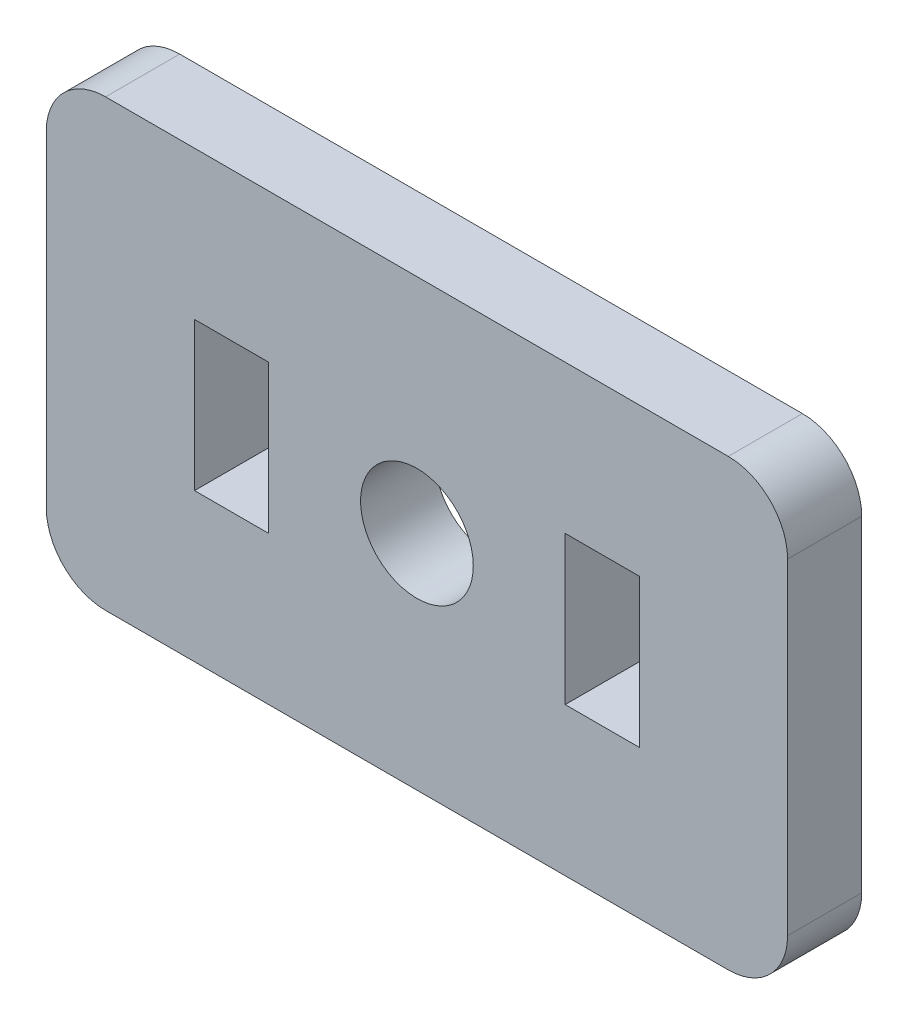
ISO-10303-21;
HEADER;
FILE_DESCRIPTION(('STEP AP214'),'2;1');
FILE_NAME('part.step','',(''),(''),'','','');
FILE_SCHEMA(('AUTOMOTIVE_DESIGN { 1 0 10303 214 1 1 1 1 }'));
ENDSEC;
DATA;
#1=APPLICATION_CONTEXT('core data for automotive mechanical design processes');
#2=APPLICATION_PROTOCOL_DEFINITION('international standard','automotive_design',2000,#1);
#3=PRODUCT_CONTEXT('',#1,'mechanical');
#4=PRODUCT('Part','Part','',(#3));
#5=PRODUCT_RELATED_PRODUCT_CATEGORY('part','',(#4));
#6=PRODUCT_DEFINITION_FORMATION('','',#4);
#7=PRODUCT_DEFINITION_CONTEXT('part definition',#1,'design');
#8=PRODUCT_DEFINITION('design','',#6,#7);
#9=PRODUCT_DEFINITION_SHAPE('','',#8);
#10=(LENGTH_UNIT() NAMED_UNIT(*) SI_UNIT(.MILLI.,.METRE.));
#11=(NAMED_UNIT(*) PLANE_ANGLE_UNIT() SI_UNIT($,.RADIAN.));
#12=(NAMED_UNIT(*) SI_UNIT($,.STERADIAN.) SOLID_ANGLE_UNIT());
#13=UNCERTAINTY_MEASURE_WITH_UNIT(LENGTH_MEASURE(1.E-05),#10,'distance_accuracy_value','');
#14=(GEOMETRIC_REPRESENTATION_CONTEXT(3) GLOBAL_UNCERTAINTY_ASSIGNED_CONTEXT((#13)) GLOBAL_UNIT_ASSIGNED_CONTEXT((#10,
#11,#12)) REPRESENTATION_CONTEXT('',''));
#15=CARTESIAN_POINT('',(0.,0.,0.));
#16=DIRECTION('',(0.,0.,1.));
#17=DIRECTION('',(1.,0.,0.));
#18=AXIS2_PLACEMENT_3D('',#15,#16,#17);
#19=CARTESIAN_POINT('',(0.,-9.52500000000001,3.175));
#20=DIRECTION('',(0.,-1.,0.));
#21=DIRECTION('',(0.,0.,-1.));
#22=AXIS2_PLACEMENT_3D('',#19,#20,#21);
#23=PLANE('',#22);
#24=DIRECTION('',(-1.,0.,0.));
#25=VECTOR('',#24,1.);
#26=CARTESIAN_POINT('',(0.,-9.52500000000001,3.175));
#27=LINE('',#26,#25);
#28=CARTESIAN_POINT('',(13.335,-9.52500000000001,3.175));
#29=VERTEX_POINT('',#28);
#30=CARTESIAN_POINT('',(-13.335,-9.52500000000001,3.175));
#31=VERTEX_POINT('',#30);
#32=EDGE_CURVE('E246',#29,#31,#27,.T.);
#33=ORIENTED_EDGE('',*,*,#32,.T.);
#34=DIRECTION('',(0.,0.,-1.));
#35=VECTOR('',#34,1.);
#36=CARTESIAN_POINT('',(-13.335,-9.52500000000001,3.175));
#37=LINE('',#36,#35);
#38=CARTESIAN_POINT('',(-13.335,-9.52500000000001,0.));
#39=VERTEX_POINT('',#38);
#40=EDGE_CURVE('E288',#31,#39,#37,.T.);
#41=ORIENTED_EDGE('',*,*,#40,.T.);
#42=DIRECTION('',(-1.,0.,0.));
#43=VECTOR('',#42,1.);
#44=CARTESIAN_POINT('',(0.,-9.52500000000001,0.));
#45=LINE('',#44,#43);
#46=CARTESIAN_POINT('',(13.335,-9.52500000000001,0.));
#47=VERTEX_POINT('',#46);
#48=EDGE_CURVE('E172',#47,#39,#45,.T.);
#49=ORIENTED_EDGE('',*,*,#48,.F.);
#50=DIRECTION('',(0.,0.,-1.));
#51=VECTOR('',#50,1.);
#52=CARTESIAN_POINT('',(13.335,-9.52500000000001,3.175));
#53=LINE('',#52,#51);
#54=EDGE_CURVE('E267',#47,#29,#53,.F.);
#55=ORIENTED_EDGE('',*,*,#54,.T.);
#56=EDGE_LOOP('',(#33,#41,#49,#55));
#57=FACE_BOUND('',#56,.T.);
#58=ADVANCED_FACE('F40',(#57),#23,.T.);
#59=CARTESIAN_POINT('',(15.875,0.,3.175));
#60=DIRECTION('',(-1.,0.,0.));
#61=DIRECTION('',(0.,0.,1.));
#62=AXIS2_PLACEMENT_3D('',#59,#60,#61);
#63=PLANE('',#62);
#64=DIRECTION('',(0.,1.,0.));
#65=VECTOR('',#64,1.);
#66=CARTESIAN_POINT('',(15.875,0.,3.175));
#67=LINE('',#66,#65);
#68=CARTESIAN_POINT('',(15.875,-6.985,3.175));
#69=VERTEX_POINT('',#68);
#70=CARTESIAN_POINT('',(15.875,6.985,3.175));
#71=VERTEX_POINT('',#70);
#72=EDGE_CURVE('E250',#69,#71,#67,.T.);
#73=ORIENTED_EDGE('',*,*,#72,.F.);
#74=DIRECTION('',(0.,0.,-1.));
#75=VECTOR('',#74,1.);
#76=CARTESIAN_POINT('',(15.875,-6.985,0.));
#77=LINE('',#76,#75);
#78=CARTESIAN_POINT('',(15.875,-6.985,0.));
#79=VERTEX_POINT('',#78);
#80=EDGE_CURVE('E326',#69,#79,#77,.T.);
#81=ORIENTED_EDGE('',*,*,#80,.T.);
#82=DIRECTION('',(0.,1.,0.));
#83=VECTOR('',#82,1.);
#84=CARTESIAN_POINT('',(15.875,0.,0.));
#85=LINE('',#84,#83);
#86=CARTESIAN_POINT('',(15.875,6.985,0.));
#87=VERTEX_POINT('',#86);
#88=EDGE_CURVE('E271',#79,#87,#85,.T.);
#89=ORIENTED_EDGE('',*,*,#88,.T.);
#90=DIRECTION('',(0.,0.,-1.));
#91=VECTOR('',#90,1.);
#92=CARTESIAN_POINT('',(15.875,6.985,3.175));
#93=LINE('',#92,#91);
#94=EDGE_CURVE('E323',#87,#71,#93,.F.);
#95=ORIENTED_EDGE('',*,*,#94,.T.);
#96=EDGE_LOOP('',(#73,#81,#89,#95));
#97=FACE_BOUND('',#96,.T.);
#98=ADVANCED_FACE('F365',(#97),#63,.F.);
#99=CARTESIAN_POINT('',(0.,9.525,3.175));
#100=DIRECTION('',(0.,-1.,0.));
#101=DIRECTION('',(0.,0.,-1.));
#102=AXIS2_PLACEMENT_3D('',#99,#100,#101);
#103=PLANE('',#102);
#104=DIRECTION('',(-1.,0.,0.));
#105=VECTOR('',#104,1.);
#106=CARTESIAN_POINT('',(0.,9.525,3.175));
#107=LINE('',#106,#105);
#108=CARTESIAN_POINT('',(13.335,9.525,3.175));
#109=VERTEX_POINT('',#108);
#110=CARTESIAN_POINT('',(-13.335,9.525,3.175));
#111=VERTEX_POINT('',#110);
#112=EDGE_CURVE('E255',#109,#111,#107,.T.);
#113=ORIENTED_EDGE('',*,*,#112,.F.);
#114=DIRECTION('',(0.,0.,-1.));
#115=VECTOR('',#114,1.);
#116=CARTESIAN_POINT('',(13.335,9.525,3.175));
#117=LINE('',#116,#115);
#118=CARTESIAN_POINT('',(13.335,9.525,0.));
#119=VERTEX_POINT('',#118);
#120=EDGE_CURVE('E11',#109,#119,#117,.T.);
#121=ORIENTED_EDGE('',*,*,#120,.T.);
#122=DIRECTION('',(-1.,0.,0.));
#123=VECTOR('',#122,1.);
#124=CARTESIAN_POINT('',(0.,9.525,0.));
#125=LINE('',#124,#123);
#126=CARTESIAN_POINT('',(-13.335,9.525,0.));
#127=VERTEX_POINT('',#126);
#128=EDGE_CURVE('E275',#119,#127,#125,.T.);
#129=ORIENTED_EDGE('',*,*,#128,.T.);
#130=DIRECTION('',(0.,0.,-1.));
#131=VECTOR('',#130,1.);
#132=CARTESIAN_POINT('',(-13.335,9.525,3.175));
#133=LINE('',#132,#131);
#134=EDGE_CURVE('E49',#127,#111,#133,.F.);
#135=ORIENTED_EDGE('',*,*,#134,.T.);
#136=EDGE_LOOP('',(#113,#121,#129,#135));
#137=FACE_BOUND('',#136,.T.);
#138=ADVANCED_FACE('F333',(#137),#103,.F.);
#139=CARTESIAN_POINT('',(-15.875,0.,3.175));
#140=DIRECTION('',(-1.,0.,0.));
#141=DIRECTION('',(0.,0.,1.));
#142=AXIS2_PLACEMENT_3D('',#139,#140,#141);
#143=PLANE('',#142);
#144=DIRECTION('',(0.,1.,0.));
#145=VECTOR('',#144,1.);
#146=CARTESIAN_POINT('',(-15.875,0.,0.));
#147=LINE('',#146,#145);
#148=CARTESIAN_POINT('',(-15.875,-6.985,0.));
#149=VERTEX_POINT('',#148);
#150=CARTESIAN_POINT('',(-15.875,6.985,0.));
#151=VERTEX_POINT('',#150);
#152=EDGE_CURVE('E279',#149,#151,#147,.T.);
#153=ORIENTED_EDGE('',*,*,#152,.F.);
#154=DIRECTION('',(0.,0.,-1.));
#155=VECTOR('',#154,1.);
#156=CARTESIAN_POINT('',(-15.875,-6.985,3.175));
#157=LINE('',#156,#155);
#158=CARTESIAN_POINT('',(-15.875,-6.985,3.175));
#159=VERTEX_POINT('',#158);
#160=EDGE_CURVE('E308',#149,#159,#157,.F.);
#161=ORIENTED_EDGE('',*,*,#160,.T.);
#162=DIRECTION('',(0.,1.,0.));
#163=VECTOR('',#162,1.);
#164=CARTESIAN_POINT('',(-15.875,0.,3.175));
#165=LINE('',#164,#163);
#166=CARTESIAN_POINT('',(-15.875,6.985,3.175));
#167=VERTEX_POINT('',#166);
#168=EDGE_CURVE('E259',#159,#167,#165,.T.);
#169=ORIENTED_EDGE('',*,*,#168,.T.);
#170=DIRECTION('',(0.,0.,-1.));
#171=VECTOR('',#170,1.);
#172=CARTESIAN_POINT('',(-15.875,6.985,0.));
#173=LINE('',#172,#171);
#174=EDGE_CURVE('E304',#167,#151,#173,.T.);
#175=ORIENTED_EDGE('',*,*,#174,.T.);
#176=EDGE_LOOP('',(#153,#161,#169,#175));
#177=FACE_BOUND('',#176,.T.);
#178=ADVANCED_FACE('F346',(#177),#143,.T.);
#179=CARTESIAN_POINT('',(0.,0.,3.175));
#180=DIRECTION('',(0.,0.,-1.));
#181=DIRECTION('',(-1.,0.,0.));
#182=AXIS2_PLACEMENT_3D('',#179,#180,#181);
#183=CYLINDRICAL_SURFACE('',#182,2.413);
#184=CARTESIAN_POINT('',(0.,0.,3.175));
#185=DIRECTION('',(0.,0.,1.));
#186=DIRECTION('',(1.,0.,0.));
#187=AXIS2_PLACEMENT_3D('',#184,#185,#186);
#188=CIRCLE('',#187,2.413);
#189=CARTESIAN_POINT('',(2.413,0.,3.175));
#190=VERTEX_POINT('',#189);
#191=EDGE_CURVE('E263',#190,#190,#188,.T.);
#192=ORIENTED_EDGE('',*,*,#191,.T.);
#193=EDGE_LOOP('',(#192));
#194=FACE_BOUND('',#193,.T.);
#195=CARTESIAN_POINT('',(0.,0.,0.));
#196=DIRECTION('',(0.,0.,1.));
#197=DIRECTION('',(1.,0.,0.));
#198=AXIS2_PLACEMENT_3D('',#195,#196,#197);
#199=CIRCLE('',#198,2.413);
#200=CARTESIAN_POINT('',(2.413,0.,0.));
#201=VERTEX_POINT('',#200);
#202=EDGE_CURVE('E251',#201,#201,#199,.T.);
#203=ORIENTED_EDGE('',*,*,#202,.F.);
#204=EDGE_LOOP('',(#203));
#205=FACE_BOUND('',#204,.T.);
#206=ADVANCED_FACE('F394',(#194,#205),#183,.F.);
#207=CARTESIAN_POINT('',(0.,0.,3.175));
#208=DIRECTION('',(0.,0.,1.));
#209=DIRECTION('',(1.,0.,0.));
#210=AXIS2_PLACEMENT_3D('',#207,#208,#209);
#211=PLANE('',#210);
#212=DIRECTION('',(0.,-1.,0.));
#213=VECTOR('',#212,1.);
#214=CARTESIAN_POINT('',(6.35,3.175,3.175));
#215=LINE('',#214,#213);
#216=CARTESIAN_POINT('',(6.35,3.175,3.175));
#217=VERTEX_POINT('',#216);
#218=CARTESIAN_POINT('',(6.35,-3.175,3.175));
#219=VERTEX_POINT('',#218);
#220=EDGE_CURVE('E56',#217,#219,#215,.T.);
#221=ORIENTED_EDGE('',*,*,#220,.F.);
#222=DIRECTION('',(-1.,0.,0.));
#223=VECTOR('',#222,1.);
#224=CARTESIAN_POINT('',(6.35,3.175,3.175));
#225=LINE('',#224,#223);
#226=CARTESIAN_POINT('',(9.525,3.175,3.175));
#227=VERTEX_POINT('',#226);
#228=EDGE_CURVE('E163',#227,#217,#225,.T.);
#229=ORIENTED_EDGE('',*,*,#228,.F.);
#230=DIRECTION('',(0.,1.,0.));
#231=VECTOR('',#230,1.);
#232=CARTESIAN_POINT('',(9.525,3.175,3.175));
#233=LINE('',#232,#231);
#234=CARTESIAN_POINT('',(9.525,-3.175,3.175));
#235=VERTEX_POINT('',#234);
#236=EDGE_CURVE('E191',#235,#227,#233,.T.);
#237=ORIENTED_EDGE('',*,*,#236,.F.);
#238=DIRECTION('',(1.,0.,0.));
#239=VECTOR('',#238,1.);
#240=CARTESIAN_POINT('',(6.35,-3.175,3.175));
#241=LINE('',#240,#239);
#242=EDGE_CURVE('E183',#219,#235,#241,.T.);
#243=ORIENTED_EDGE('',*,*,#242,.F.);
#244=EDGE_LOOP('',(#221,#229,#237,#243));
#245=FACE_BOUND('',#244,.T.);
#246=DIRECTION('',(0.,-1.,0.));
#247=VECTOR('',#246,1.);
#248=CARTESIAN_POINT('',(-9.525,3.175,3.175));
#249=LINE('',#248,#247);
#250=CARTESIAN_POINT('',(-9.525,3.175,3.175));
#251=VERTEX_POINT('',#250);
#252=CARTESIAN_POINT('',(-9.525,-3.175,3.175));
#253=VERTEX_POINT('',#252);
#254=EDGE_CURVE('E64',#251,#253,#249,.T.);
#255=ORIENTED_EDGE('',*,*,#254,.F.);
#256=DIRECTION('',(-1.,0.,0.));
#257=VECTOR('',#256,1.);
#258=CARTESIAN_POINT('',(-9.525,3.175,3.175));
#259=LINE('',#258,#257);
#260=CARTESIAN_POINT('',(-6.35,3.175,3.175));
#261=VERTEX_POINT('',#260);
#262=EDGE_CURVE('E226',#261,#251,#259,.T.);
#263=ORIENTED_EDGE('',*,*,#262,.F.);
#264=DIRECTION('',(0.,1.,0.));
#265=VECTOR('',#264,1.);
#266=CARTESIAN_POINT('',(-6.35,3.175,3.175));
#267=LINE('',#266,#265);
#268=CARTESIAN_POINT('',(-6.35,-3.175,3.175));
#269=VERTEX_POINT('',#268);
#270=EDGE_CURVE('E222',#269,#261,#267,.T.);
#271=ORIENTED_EDGE('',*,*,#270,.F.);
#272=DIRECTION('',(1.,0.,0.));
#273=VECTOR('',#272,1.);
#274=CARTESIAN_POINT('',(-9.525,-3.175,3.175));
#275=LINE('',#274,#273);
#276=EDGE_CURVE('E218',#253,#269,#275,.T.);
#277=ORIENTED_EDGE('',*,*,#276,.F.);
#278=EDGE_LOOP('',(#255,#263,#271,#277));
#279=FACE_BOUND('',#278,.T.);
#280=ORIENTED_EDGE('',*,*,#168,.F.);
#281=CARTESIAN_POINT('',(-13.335,-6.985,3.175));
#282=DIRECTION('',(0.,0.,1.));
#283=DIRECTION('',(1.,0.,0.));
#284=AXIS2_PLACEMENT_3D('',#281,#282,#283);
#285=CIRCLE('',#284,2.54);
#286=EDGE_CURVE('E320',#159,#31,#285,.T.);
#287=ORIENTED_EDGE('',*,*,#286,.T.);
#288=ORIENTED_EDGE('',*,*,#32,.F.);
#289=CARTESIAN_POINT('',(13.335,-6.985,3.175));
#290=DIRECTION('',(0.,0.,1.));
#291=DIRECTION('',(1.,0.,0.));
#292=AXIS2_PLACEMENT_3D('',#289,#290,#291);
#293=CIRCLE('',#292,2.54);
#294=EDGE_CURVE('E317',#29,#69,#293,.T.);
#295=ORIENTED_EDGE('',*,*,#294,.T.);
#296=ORIENTED_EDGE('',*,*,#72,.T.);
#297=CARTESIAN_POINT('',(13.335,6.985,3.175));
#298=DIRECTION('',(0.,0.,1.));
#299=DIRECTION('',(1.,0.,0.));
#300=AXIS2_PLACEMENT_3D('',#297,#298,#299);
#301=CIRCLE('',#300,2.54);
#302=EDGE_CURVE('E314',#71,#109,#301,.T.);
#303=ORIENTED_EDGE('',*,*,#302,.T.);
#304=ORIENTED_EDGE('',*,*,#112,.T.);
#305=CARTESIAN_POINT('',(-13.335,6.985,3.175));
#306=DIRECTION('',(0.,0.,1.));
#307=DIRECTION('',(1.,0.,0.));
#308=AXIS2_PLACEMENT_3D('',#305,#306,#307);
#309=CIRCLE('',#308,2.54);
#310=EDGE_CURVE('E311',#111,#167,#309,.T.);
#311=ORIENTED_EDGE('',*,*,#310,.T.);
#312=EDGE_LOOP('',(#280,#287,#288,#295,#296,#303,#304,#311));
#313=FACE_BOUND('',#312,.T.);
#314=ORIENTED_EDGE('',*,*,#191,.F.);
#315=EDGE_LOOP('',(#314));
#316=FACE_BOUND('',#315,.T.);
#317=ADVANCED_FACE('F340',(#245,#279,#313,#316),#211,.T.);
#318=CARTESIAN_POINT('',(0.,0.,0.));
#319=DIRECTION('',(0.,0.,1.));
#320=DIRECTION('',(1.,0.,0.));
#321=AXIS2_PLACEMENT_3D('',#318,#319,#320);
#322=PLANE('',#321);
#323=DIRECTION('',(1.,0.,0.));
#324=VECTOR('',#323,1.);
#325=CARTESIAN_POINT('',(6.35,3.175,0.));
#326=LINE('',#325,#324);
#327=CARTESIAN_POINT('',(6.35,3.175,0.));
#328=VERTEX_POINT('',#327);
#329=CARTESIAN_POINT('',(9.525,3.175,0.));
#330=VERTEX_POINT('',#329);
#331=EDGE_CURVE('E178',#328,#330,#326,.T.);
#332=ORIENTED_EDGE('',*,*,#331,.F.);
#333=DIRECTION('',(0.,1.,0.));
#334=VECTOR('',#333,1.);
#335=CARTESIAN_POINT('',(6.35,3.175,0.));
#336=LINE('',#335,#334);
#337=CARTESIAN_POINT('',(6.35,-3.175,0.));
#338=VERTEX_POINT('',#337);
#339=EDGE_CURVE('E156',#338,#328,#336,.T.);
#340=ORIENTED_EDGE('',*,*,#339,.F.);
#341=DIRECTION('',(-1.,0.,0.));
#342=VECTOR('',#341,1.);
#343=CARTESIAN_POINT('',(6.35,-3.175,0.));
#344=LINE('',#343,#342);
#345=CARTESIAN_POINT('',(9.525,-3.175,0.));
#346=VERTEX_POINT('',#345);
#347=EDGE_CURVE('E167',#346,#338,#344,.T.);
#348=ORIENTED_EDGE('',*,*,#347,.F.);
#349=DIRECTION('',(0.,-1.,0.));
#350=VECTOR('',#349,1.);
#351=CARTESIAN_POINT('',(9.525,3.175,0.));
#352=LINE('',#351,#350);
#353=EDGE_CURVE('E185',#330,#346,#352,.T.);
#354=ORIENTED_EDGE('',*,*,#353,.F.);
#355=EDGE_LOOP('',(#332,#340,#348,#354));
#356=FACE_BOUND('',#355,.T.);
#357=DIRECTION('',(1.,0.,0.));
#358=VECTOR('',#357,1.);
#359=CARTESIAN_POINT('',(-9.525,3.175,0.));
#360=LINE('',#359,#358);
#361=CARTESIAN_POINT('',(-9.525,3.175,0.));
#362=VERTEX_POINT('',#361);
#363=CARTESIAN_POINT('',(-6.35,3.175,0.));
#364=VERTEX_POINT('',#363);
#365=EDGE_CURVE('E208',#362,#364,#360,.T.);
#366=ORIENTED_EDGE('',*,*,#365,.F.);
#367=DIRECTION('',(0.,1.,0.));
#368=VECTOR('',#367,1.);
#369=CARTESIAN_POINT('',(-9.525,3.175,0.));
#370=LINE('',#369,#368);
#371=CARTESIAN_POINT('',(-9.525,-3.175,0.));
#372=VERTEX_POINT('',#371);
#373=EDGE_CURVE('E212',#372,#362,#370,.T.);
#374=ORIENTED_EDGE('',*,*,#373,.F.);
#375=DIRECTION('',(-1.,0.,0.));
#376=VECTOR('',#375,1.);
#377=CARTESIAN_POINT('',(-9.525,-3.175,0.));
#378=LINE('',#377,#376);
#379=CARTESIAN_POINT('',(-6.35,-3.175,0.));
#380=VERTEX_POINT('',#379);
#381=EDGE_CURVE('E234',#380,#372,#378,.T.);
#382=ORIENTED_EDGE('',*,*,#381,.F.);
#383=DIRECTION('',(0.,-1.,0.));
#384=VECTOR('',#383,1.);
#385=CARTESIAN_POINT('',(-6.35,3.175,0.));
#386=LINE('',#385,#384);
#387=EDGE_CURVE('E205',#364,#380,#386,.T.);
#388=ORIENTED_EDGE('',*,*,#387,.F.);
#389=EDGE_LOOP('',(#366,#374,#382,#388));
#390=FACE_BOUND('',#389,.T.);
#391=ORIENTED_EDGE('',*,*,#48,.T.);
#392=CARTESIAN_POINT('',(-13.335,-6.985,0.));
#393=DIRECTION('',(0.,0.,1.));
#394=DIRECTION('',(1.,0.,0.));
#395=AXIS2_PLACEMENT_3D('',#392,#393,#394);
#396=CIRCLE('',#395,2.54);
#397=EDGE_CURVE('E301',#39,#149,#396,.F.);
#398=ORIENTED_EDGE('',*,*,#397,.T.);
#399=ORIENTED_EDGE('',*,*,#152,.T.);
#400=CARTESIAN_POINT('',(-13.335,6.985,0.));
#401=DIRECTION('',(0.,0.,1.));
#402=DIRECTION('',(1.,0.,0.));
#403=AXIS2_PLACEMENT_3D('',#400,#401,#402);
#404=CIRCLE('',#403,2.54);
#405=EDGE_CURVE('E292',#151,#127,#404,.F.);
#406=ORIENTED_EDGE('',*,*,#405,.T.);
#407=ORIENTED_EDGE('',*,*,#128,.F.);
#408=CARTESIAN_POINT('',(13.335,6.985,0.));
#409=DIRECTION('',(0.,0.,1.));
#410=DIRECTION('',(1.,0.,0.));
#411=AXIS2_PLACEMENT_3D('',#408,#409,#410);
#412=CIRCLE('',#411,2.54);
#413=EDGE_CURVE('E295',#119,#87,#412,.F.);
#414=ORIENTED_EDGE('',*,*,#413,.T.);
#415=ORIENTED_EDGE('',*,*,#88,.F.);
#416=CARTESIAN_POINT('',(13.335,-6.985,0.));
#417=DIRECTION('',(0.,0.,1.));
#418=DIRECTION('',(1.,0.,0.));
#419=AXIS2_PLACEMENT_3D('',#416,#417,#418);
#420=CIRCLE('',#419,2.54);
#421=EDGE_CURVE('E298',#79,#47,#420,.F.);
#422=ORIENTED_EDGE('',*,*,#421,.T.);
#423=EDGE_LOOP('',(#391,#398,#399,#406,#407,#414,#415,#422));
#424=FACE_BOUND('',#423,.T.);
#425=ORIENTED_EDGE('',*,*,#202,.T.);
#426=EDGE_LOOP('',(#425));
#427=FACE_BOUND('',#426,.T.);
#428=ADVANCED_FACE('F175',(#356,#390,#424,#427),#322,.F.);
#429=CARTESIAN_POINT('',(-13.335,-6.985,3.175));
#430=DIRECTION('',(0.,0.,-1.));
#431=DIRECTION('',(-1.,0.,0.));
#432=AXIS2_PLACEMENT_3D('',#429,#430,#431);
#433=CYLINDRICAL_SURFACE('',#432,2.54);
#434=ORIENTED_EDGE('',*,*,#286,.F.);
#435=ORIENTED_EDGE('',*,*,#160,.F.);
#436=ORIENTED_EDGE('',*,*,#397,.F.);
#437=ORIENTED_EDGE('',*,*,#40,.F.);
#438=EDGE_LOOP('',(#434,#435,#436,#437));
#439=FACE_BOUND('',#438,.T.);
#440=ADVANCED_FACE('F354',(#439),#433,.T.);
#441=CARTESIAN_POINT('',(13.335,-6.985,3.175));
#442=DIRECTION('',(0.,0.,1.));
#443=DIRECTION('',(1.,0.,0.));
#444=AXIS2_PLACEMENT_3D('',#441,#442,#443);
#445=CYLINDRICAL_SURFACE('',#444,2.54);
#446=ORIENTED_EDGE('',*,*,#294,.F.);
#447=ORIENTED_EDGE('',*,*,#54,.F.);
#448=ORIENTED_EDGE('',*,*,#421,.F.);
#449=ORIENTED_EDGE('',*,*,#80,.F.);
#450=EDGE_LOOP('',(#446,#447,#448,#449));
#451=FACE_BOUND('',#450,.T.);
#452=ADVANCED_FACE('F362',(#451),#445,.T.);
#453=CARTESIAN_POINT('',(13.335,6.985,3.175));
#454=DIRECTION('',(0.,0.,-1.));
#455=DIRECTION('',(-1.,0.,0.));
#456=AXIS2_PLACEMENT_3D('',#453,#454,#455);
#457=CYLINDRICAL_SURFACE('',#456,2.54);
#458=ORIENTED_EDGE('',*,*,#302,.F.);
#459=ORIENTED_EDGE('',*,*,#94,.F.);
#460=ORIENTED_EDGE('',*,*,#413,.F.);
#461=ORIENTED_EDGE('',*,*,#120,.F.);
#462=EDGE_LOOP('',(#458,#459,#460,#461));
#463=FACE_BOUND('',#462,.T.);
#464=ADVANCED_FACE('F368',(#463),#457,.T.);
#465=CARTESIAN_POINT('',(-13.335,6.985,3.175));
#466=DIRECTION('',(0.,0.,1.));
#467=DIRECTION('',(1.,0.,0.));
#468=AXIS2_PLACEMENT_3D('',#465,#466,#467);
#469=CYLINDRICAL_SURFACE('',#468,2.54);
#470=ORIENTED_EDGE('',*,*,#310,.F.);
#471=ORIENTED_EDGE('',*,*,#134,.F.);
#472=ORIENTED_EDGE('',*,*,#405,.F.);
#473=ORIENTED_EDGE('',*,*,#174,.F.);
#474=EDGE_LOOP('',(#470,#471,#472,#473));
#475=FACE_BOUND('',#474,.T.);
#476=ADVANCED_FACE('F42',(#475),#469,.T.);
#477=CARTESIAN_POINT('',(-9.525,3.175,-0.00100000000000013));
#478=DIRECTION('',(-1.,0.,0.));
#479=DIRECTION('',(0.,0.,1.));
#480=AXIS2_PLACEMENT_3D('',#477,#478,#479);
#481=PLANE('',#480);
#482=ORIENTED_EDGE('',*,*,#373,.T.);
#483=DIRECTION('',(0.,0.,1.));
#484=VECTOR('',#483,1.);
#485=CARTESIAN_POINT('',(-9.525,3.175,-0.00100000000000013));
#486=LINE('',#485,#484);
#487=EDGE_CURVE('E231',#362,#251,#486,.T.);
#488=ORIENTED_EDGE('',*,*,#487,.T.);
#489=ORIENTED_EDGE('',*,*,#254,.T.);
#490=DIRECTION('',(0.,0.,1.));
#491=VECTOR('',#490,1.);
#492=CARTESIAN_POINT('',(-9.525,-3.175,-0.00100000000000013));
#493=LINE('',#492,#491);
#494=EDGE_CURVE('E230',#372,#253,#493,.T.);
#495=ORIENTED_EDGE('',*,*,#494,.F.);
#496=EDGE_LOOP('',(#482,#488,#489,#495));
#497=FACE_BOUND('',#496,.T.);
#498=ADVANCED_FACE('F374',(#497),#481,.F.);
#499=CARTESIAN_POINT('',(-9.525,3.175,-0.00100000000000013));
#500=DIRECTION('',(0.,1.,0.));
#501=DIRECTION('',(-1.,0.,0.));
#502=AXIS2_PLACEMENT_3D('',#499,#500,#501);
#503=PLANE('',#502);
#504=ORIENTED_EDGE('',*,*,#365,.T.);
#505=DIRECTION('',(0.,0.,1.));
#506=VECTOR('',#505,1.);
#507=CARTESIAN_POINT('',(-6.35,3.175,-0.00100000000000013));
#508=LINE('',#507,#506);
#509=EDGE_CURVE('E235',#364,#261,#508,.T.);
#510=ORIENTED_EDGE('',*,*,#509,.T.);
#511=ORIENTED_EDGE('',*,*,#262,.T.);
#512=ORIENTED_EDGE('',*,*,#487,.F.);
#513=EDGE_LOOP('',(#504,#510,#511,#512));
#514=FACE_BOUND('',#513,.T.);
#515=ADVANCED_FACE('F489',(#514),#503,.F.);
#516=CARTESIAN_POINT('',(-6.35,3.175,-0.00100000000000013));
#517=DIRECTION('',(1.,0.,0.));
#518=DIRECTION('',(0.,0.,-1.));
#519=AXIS2_PLACEMENT_3D('',#516,#517,#518);
#520=PLANE('',#519);
#521=ORIENTED_EDGE('',*,*,#387,.T.);
#522=DIRECTION('',(0.,0.,1.));
#523=VECTOR('',#522,1.);
#524=CARTESIAN_POINT('',(-6.35,-3.175,-0.00100000000000013));
#525=LINE('',#524,#523);
#526=EDGE_CURVE('E238',#380,#269,#525,.T.);
#527=ORIENTED_EDGE('',*,*,#526,.T.);
#528=ORIENTED_EDGE('',*,*,#270,.T.);
#529=ORIENTED_EDGE('',*,*,#509,.F.);
#530=EDGE_LOOP('',(#521,#527,#528,#529));
#531=FACE_BOUND('',#530,.T.);
#532=ADVANCED_FACE('F494',(#531),#520,.F.);
#533=CARTESIAN_POINT('',(-9.525,-3.175,-0.00100000000000013));
#534=DIRECTION('',(0.,-1.,0.));
#535=DIRECTION('',(1.,0.,0.));
#536=AXIS2_PLACEMENT_3D('',#533,#534,#535);
#537=PLANE('',#536);
#538=ORIENTED_EDGE('',*,*,#381,.T.);
#539=ORIENTED_EDGE('',*,*,#494,.T.);
#540=ORIENTED_EDGE('',*,*,#276,.T.);
#541=ORIENTED_EDGE('',*,*,#526,.F.);
#542=EDGE_LOOP('',(#538,#539,#540,#541));
#543=FACE_BOUND('',#542,.T.);
#544=ADVANCED_FACE('F502',(#543),#537,.F.);
#545=CARTESIAN_POINT('',(6.35,3.175,-0.00100000000000013));
#546=DIRECTION('',(-1.,0.,0.));
#547=DIRECTION('',(0.,0.,1.));
#548=AXIS2_PLACEMENT_3D('',#545,#546,#547);
#549=PLANE('',#548);
#550=ORIENTED_EDGE('',*,*,#339,.T.);
#551=DIRECTION('',(0.,0.,1.));
#552=VECTOR('',#551,1.);
#553=CARTESIAN_POINT('',(6.35,3.175,-0.00100000000000013));
#554=LINE('',#553,#552);
#555=EDGE_CURVE('E173',#328,#217,#554,.T.);
#556=ORIENTED_EDGE('',*,*,#555,.T.);
#557=ORIENTED_EDGE('',*,*,#220,.T.);
#558=DIRECTION('',(0.,0.,1.));
#559=VECTOR('',#558,1.);
#560=CARTESIAN_POINT('',(6.35,-3.175,-0.00100000000000013));
#561=LINE('',#560,#559);
#562=EDGE_CURVE('E152',#338,#219,#561,.T.);
#563=ORIENTED_EDGE('',*,*,#562,.F.);
#564=EDGE_LOOP('',(#550,#556,#557,#563));
#565=FACE_BOUND('',#564,.T.);
#566=ADVANCED_FACE('F154',(#565),#549,.F.);
#567=CARTESIAN_POINT('',(6.35,3.175,-0.00100000000000013));
#568=DIRECTION('',(0.,1.,0.));
#569=DIRECTION('',(-1.,0.,0.));
#570=AXIS2_PLACEMENT_3D('',#567,#568,#569);
#571=PLANE('',#570);
#572=ORIENTED_EDGE('',*,*,#331,.T.);
#573=DIRECTION('',(0.,0.,1.));
#574=VECTOR('',#573,1.);
#575=CARTESIAN_POINT('',(9.525,3.175,-0.00100000000000013));
#576=LINE('',#575,#574);
#577=EDGE_CURVE('E200',#330,#227,#576,.T.);
#578=ORIENTED_EDGE('',*,*,#577,.T.);
#579=ORIENTED_EDGE('',*,*,#228,.T.);
#580=ORIENTED_EDGE('',*,*,#555,.F.);
#581=EDGE_LOOP('',(#572,#578,#579,#580));
#582=FACE_BOUND('',#581,.T.);
#583=ADVANCED_FACE('F517',(#582),#571,.F.);
#584=CARTESIAN_POINT('',(9.525,3.175,-0.00100000000000013));
#585=DIRECTION('',(1.,0.,0.));
#586=DIRECTION('',(0.,0.,-1.));
#587=AXIS2_PLACEMENT_3D('',#584,#585,#586);
#588=PLANE('',#587);
#589=ORIENTED_EDGE('',*,*,#353,.T.);
#590=DIRECTION('',(0.,0.,1.));
#591=VECTOR('',#590,1.);
#592=CARTESIAN_POINT('',(9.525,-3.175,-0.00100000000000013));
#593=LINE('',#592,#591);
#594=EDGE_CURVE('E162',#346,#235,#593,.T.);
#595=ORIENTED_EDGE('',*,*,#594,.T.);
#596=ORIENTED_EDGE('',*,*,#236,.T.);
#597=ORIENTED_EDGE('',*,*,#577,.F.);
#598=EDGE_LOOP('',(#589,#595,#596,#597));
#599=FACE_BOUND('',#598,.T.);
#600=ADVANCED_FACE('F524',(#599),#588,.F.);
#601=CARTESIAN_POINT('',(6.35,-3.175,-0.00100000000000013));
#602=DIRECTION('',(0.,-1.,0.));
#603=DIRECTION('',(1.,0.,0.));
#604=AXIS2_PLACEMENT_3D('',#601,#602,#603);
#605=PLANE('',#604);
#606=ORIENTED_EDGE('',*,*,#347,.T.);
#607=ORIENTED_EDGE('',*,*,#562,.T.);
#608=ORIENTED_EDGE('',*,*,#242,.T.);
#609=ORIENTED_EDGE('',*,*,#594,.F.);
#610=EDGE_LOOP('',(#606,#607,#608,#609));
#611=FACE_BOUND('',#610,.T.);
#612=ADVANCED_FACE('F168',(#611),#605,.F.);
#613=CLOSED_SHELL('',(#58,#98,#138,#178,#206,#317,#428,#440,#452,#464,#476,#498,#515,#532,#544,
#566,#583,#600,#612));
#614=MANIFOLD_SOLID_BREP('B2',#613);
#615=ADVANCED_BREP_SHAPE_REPRESENTATION('',(#18,#614),#14);
#616=SHAPE_DEFINITION_REPRESENTATION(#9,#615);
ENDSEC;
END-ISO-10303-21;
